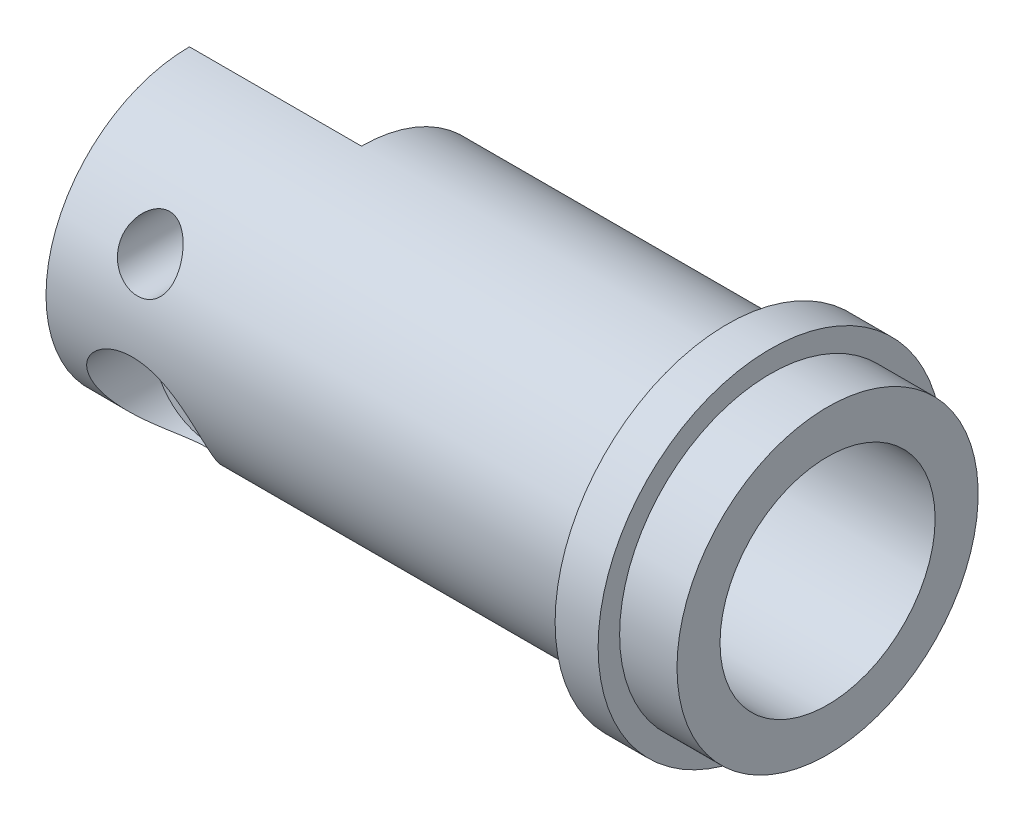
ISO-10303-21;
HEADER;
FILE_DESCRIPTION(('STEP AP214'),'2;1');
FILE_NAME('part.step','',(''),(''),'','','');
FILE_SCHEMA(('AUTOMOTIVE_DESIGN { 1 0 10303 214 1 1 1 1 }'));
ENDSEC;
DATA;
#1=APPLICATION_CONTEXT('core data for automotive mechanical design processes');
#2=APPLICATION_PROTOCOL_DEFINITION('international standard','automotive_design',2000,#1);
#3=PRODUCT_CONTEXT('',#1,'mechanical');
#4=PRODUCT('Part','Part','',(#3));
#5=PRODUCT_RELATED_PRODUCT_CATEGORY('part','',(#4));
#6=PRODUCT_DEFINITION_FORMATION('','',#4);
#7=PRODUCT_DEFINITION_CONTEXT('part definition',#1,'design');
#8=PRODUCT_DEFINITION('design','',#6,#7);
#9=PRODUCT_DEFINITION_SHAPE('','',#8);
#10=(LENGTH_UNIT() NAMED_UNIT(*) SI_UNIT(.MILLI.,.METRE.));
#11=(NAMED_UNIT(*) PLANE_ANGLE_UNIT() SI_UNIT($,.RADIAN.));
#12=(NAMED_UNIT(*) SI_UNIT($,.STERADIAN.) SOLID_ANGLE_UNIT());
#13=UNCERTAINTY_MEASURE_WITH_UNIT(LENGTH_MEASURE(1.E-05),#10,'distance_accuracy_value','');
#14=(GEOMETRIC_REPRESENTATION_CONTEXT(3) GLOBAL_UNCERTAINTY_ASSIGNED_CONTEXT((#13)) GLOBAL_UNIT_ASSIGNED_CONTEXT((#10,
#11,#12)) REPRESENTATION_CONTEXT('',''));
#15=CARTESIAN_POINT('',(0.,0.,0.));
#16=DIRECTION('',(0.,0.,1.));
#17=DIRECTION('',(1.,0.,0.));
#18=AXIS2_PLACEMENT_3D('',#15,#16,#17);
#19=CARTESIAN_POINT('',(28.2857142857142,0.,-10.));
#20=DIRECTION('',(1.,0.,0.));
#21=DIRECTION('',(0.,0.,-1.));
#22=AXIS2_PLACEMENT_3D('',#19,#20,#21);
#23=PLANE('',#22);
#24=CARTESIAN_POINT('',(28.2857142857142,0.,0.));
#25=DIRECTION('',(-1.,0.,0.));
#26=DIRECTION('',(0.,0.,1.));
#27=AXIS2_PLACEMENT_3D('',#24,#25,#26);
#28=CIRCLE('',#27,10.);
#29=CARTESIAN_POINT('',(28.2857142857142,10.,0.));
#30=VERTEX_POINT('',#29);
#31=CARTESIAN_POINT('',(28.2857142857142,2.5,-9.68245836551854));
#32=VERTEX_POINT('',#31);
#33=EDGE_CURVE('E105',#30,#32,#28,.T.);
#34=ORIENTED_EDGE('',*,*,#33,.T.);
#35=DIRECTION('',(0.,0.,1.));
#36=VECTOR('',#35,1.);
#37=CARTESIAN_POINT('',(28.2857142857142,2.5,-12.));
#38=LINE('',#37,#36);
#39=CARTESIAN_POINT('',(28.2857142857142,2.5,-1.6583123951777));
#40=VERTEX_POINT('',#39);
#41=EDGE_CURVE('E95',#32,#40,#38,.T.);
#42=ORIENTED_EDGE('',*,*,#41,.T.);
#43=CARTESIAN_POINT('',(28.2857142857142,0.,0.));
#44=DIRECTION('',(1.,0.,0.));
#45=DIRECTION('',(0.,0.,-1.));
#46=AXIS2_PLACEMENT_3D('',#43,#44,#45);
#47=CIRCLE('',#46,3.);
#48=CARTESIAN_POINT('',(28.2857142857142,3.,0.));
#49=VERTEX_POINT('',#48);
#50=EDGE_CURVE('E102',#40,#49,#47,.T.);
#51=ORIENTED_EDGE('',*,*,#50,.T.);
#52=DIRECTION('',(0.,-1.,0.));
#53=VECTOR('',#52,1.);
#54=CARTESIAN_POINT('',(28.2857142857142,-10.,0.));
#55=LINE('',#54,#53);
#56=EDGE_CURVE('E231',#30,#49,#55,.T.);
#57=ORIENTED_EDGE('',*,*,#56,.F.);
#58=EDGE_LOOP('',(#34,#42,#51,#57));
#59=FACE_BOUND('',#58,.T.);
#60=ADVANCED_FACE('F38',(#59),#23,.F.);
#61=CARTESIAN_POINT('',(28.2857142857142,0.,0.));
#62=DIRECTION('',(-1.,0.,0.));
#63=DIRECTION('',(0.,0.,1.));
#64=AXIS2_PLACEMENT_3D('',#61,#62,#63);
#65=CYLINDRICAL_SURFACE('',#64,10.);
#66=CARTESIAN_POINT('',(18.2857142857142,-4.75,8.79985795339902));
#67=CARTESIAN_POINT('',(18.2857146794941,-4.64775511107819,8.85504731481394));
#68=CARTESIAN_POINT('',(18.2896368453553,-4.54453071109827,8.90846095213378));
#69=CARTESIAN_POINT('',(18.3057495382989,-4.33680054123675,9.01141502919795));
#70=CARTESIAN_POINT('',(18.3179400695199,-4.23229477071377,9.06095546700354));
#71=CARTESIAN_POINT('',(18.3509754213236,-4.02260000063724,9.15597930084683));
#72=CARTESIAN_POINT('',(18.3718333296483,-3.91741020566567,9.20145643457565));
#73=CARTESIAN_POINT('',(18.4224622636949,-3.70743576191147,9.28804664079346));
#74=CARTESIAN_POINT('',(18.4522288475649,-3.60265093752256,9.32916187431385));
#75=CARTESIAN_POINT('',(18.5209723811106,-3.39396306671426,9.40709689541834));
#76=CARTESIAN_POINT('',(18.5599870624851,-3.29006548849983,9.44389813775748));
#77=CARTESIAN_POINT('',(18.6471546774966,-3.08466980799321,9.51296737058453));
#78=CARTESIAN_POINT('',(18.6953040663803,-2.9831707920558,9.54523711111156));
#79=CARTESIAN_POINT('',(18.800600196153,-2.78360596859954,9.60533170008504));
#80=CARTESIAN_POINT('',(18.8577451359448,-2.68553947861152,9.6331574360721));
#81=CARTESIAN_POINT('',(18.9807486412899,-2.49385997778815,9.68455001775173));
#82=CARTESIAN_POINT('',(19.0466067135786,-2.40024671525585,9.70811710435489));
#83=CARTESIAN_POINT('',(19.1820519717099,-2.22437376429263,9.74986125180663));
#84=CARTESIAN_POINT('',(19.2511181823591,-2.1417716317211,9.76828915628753));
#85=CARTESIAN_POINT('',(19.3960756948511,-1.9820361015592,9.80194870076438));
#86=CARTESIAN_POINT('',(19.4719692792461,-1.9049045484412,9.81717926609884));
#87=CARTESIAN_POINT('',(19.6300177027694,-1.75684154297299,9.84475389508233));
#88=CARTESIAN_POINT('',(19.7121705247828,-1.68590810889191,9.85709888347002));
#89=CARTESIAN_POINT('',(19.8822128467565,-1.55078437178929,9.87925898186115));
#90=CARTESIAN_POINT('',(19.9701044907674,-1.48659661262561,9.88907313947818));
#91=CARTESIAN_POINT('',(20.1505076009358,-1.36582991643035,9.90647340394846));
#92=CARTESIAN_POINT('',(20.242992282968,-1.30921266776541,9.9140709787808));
#93=CARTESIAN_POINT('',(20.4323608223241,-1.20361365636595,9.9274436776013));
#94=CARTESIAN_POINT('',(20.5292462611188,-1.15463466702627,9.93321814040717));
#95=CARTESIAN_POINT('',(20.82545215876,-1.01977373813559,9.94828276969731));
#96=CARTESIAN_POINT('',(21.030498947756,-0.945849627510296,9.95532973289955));
#97=CARTESIAN_POINT('',(21.4544476531009,-0.83102804828343,9.96558160558599));
#98=CARTESIAN_POINT('',(21.6735544473667,-0.79088778149875,9.96869917015171));
#99=CARTESIAN_POINT('',(22.11544782821,-0.747466089190872,9.97204974832455));
#100=CARTESIAN_POINT('',(22.3382346790694,-0.744187322488545,9.97228255385406));
#101=CARTESIAN_POINT('',(22.7833343788602,-0.774750726007538,9.96995471278495));
#102=CARTESIAN_POINT('',(23.0056232239184,-0.808941027110835,9.9673678696076));
#103=CARTESIAN_POINT('',(23.4412896392946,-0.914005631748541,9.95828029702202));
#104=CARTESIAN_POINT('',(23.6546668689979,-0.984881336067683,9.95177941815986));
#105=CARTESIAN_POINT('',(24.0660429674837,-1.16107027916307,9.93275959609781));
#106=CARTESIAN_POINT('',(24.2640645724472,-1.26633135241922,9.92024975556217));
#107=CARTESIAN_POINT('',(24.6392545058661,-1.50799212824612,9.88639380958243));
#108=CARTESIAN_POINT('',(24.8164258673304,-1.64438729334758,9.8650489913759));
#109=CARTESIAN_POINT('',(25.1422010704683,-1.94138366405249,9.81088183714781));
#110=CARTESIAN_POINT('',(25.2911960784052,-2.10158802281518,9.7782377795457));
#111=CARTESIAN_POINT('',(25.5597774841209,-2.44186936017587,9.69885119822265));
#112=CARTESIAN_POINT('',(25.679371112943,-2.62194143664539,9.65211214736628));
#113=CARTESIAN_POINT('',(25.8845430816403,-2.99152263484594,9.54395612369488));
#114=CARTESIAN_POINT('',(25.9707415839331,-3.18077794809889,9.48284445898325));
#115=CARTESIAN_POINT('',(26.1116997453273,-3.56519093735672,9.34511092187318));
#116=CARTESIAN_POINT('',(26.1664573174046,-3.76034900427681,9.26848802030756));
#117=CARTESIAN_POINT('',(26.2466981402137,-4.15618781597649,9.09801638719833));
#118=CARTESIAN_POINT('',(26.2712639064894,-4.35686048656,9.00372373967416));
#119=CARTESIAN_POINT('',(26.2906234846291,-4.75254006726405,8.80129863202815));
#120=CARTESIAN_POINT('',(26.2854007991653,-4.94754377772921,8.69315853537593));
#121=CARTESIAN_POINT('',(26.2460612829425,-5.35147198079036,8.4512579191186));
#122=CARTESIAN_POINT('',(26.2084547419214,-5.5591402769891,8.31598269435805));
#123=CARTESIAN_POINT('',(26.1042730453924,-5.95885041765435,8.03442679104681));
#124=CARTESIAN_POINT('',(26.0376995601643,-6.15089316235709,7.88814674745355));
#125=CARTESIAN_POINT('',(25.8634141838392,-6.55493904112593,7.55737289555156));
#126=CARTESIAN_POINT('',(25.7501040195886,-6.76311867145068,7.37113575339365));
#127=CARTESIAN_POINT('',(25.5563129437588,-7.05585022869819,7.08756920416176));
#128=CARTESIAN_POINT('',(25.4875701962631,-7.15035426705791,6.99213411421136));
#129=CARTESIAN_POINT('',(25.3424186207966,-7.33265924435742,6.80070169445068));
#130=CARTESIAN_POINT('',(25.2660115628085,-7.42046172273408,6.70470449925196));
#131=CARTESIAN_POINT('',(25.0889043253059,-7.60691311247108,6.49297395858474));
#132=CARTESIAN_POINT('',(24.9864645476016,-7.7039931970862,6.37730935125372));
#133=CARTESIAN_POINT('',(24.7702692949476,-7.88801872633861,6.14823112317327));
#134=CARTESIAN_POINT('',(24.656504352454,-7.97495555736646,6.03481948246804));
#135=CARTESIAN_POINT('',(24.417556159327,-8.13763138118246,5.81357883870568));
#136=CARTESIAN_POINT('',(24.2924356964671,-8.21342652659606,5.70572375516045));
#137=CARTESIAN_POINT('',(24.0290347893763,-8.35319824433156,5.49904951414225));
#138=CARTESIAN_POINT('',(23.8907805781017,-8.41719765504708,5.40021308663245));
#139=CARTESIAN_POINT('',(23.6372244252914,-8.51653321047923,5.24166256240013));
#140=CARTESIAN_POINT('',(23.5253561518934,-8.55499016572871,5.17847194440276));
#141=CARTESIAN_POINT('',(23.2929004655457,-8.6230150259751,5.06438594208686));
#142=CARTESIAN_POINT('',(23.1723188866411,-8.65258881157613,5.01348242818396));
#143=CARTESIAN_POINT('',(22.9210033452073,-8.70131720292245,4.92844638250117));
#144=CARTESIAN_POINT('',(22.7901487856486,-8.72031663966561,4.89456429081456));
#145=CARTESIAN_POINT('',(22.5902300988773,-8.73895653188558,4.86115066343775));
#146=CARTESIAN_POINT('',(22.5230139185758,-8.74352676891557,4.85291417875754));
#147=CARTESIAN_POINT('',(22.3879738103306,-8.74926370616404,4.84256319009267));
#148=CARTESIAN_POINT('',(22.3201499819509,-8.75043095409425,4.84044770093303));
#149=CARTESIAN_POINT('',(22.1345994737618,-8.74887073177324,4.84327466911685));
#150=CARTESIAN_POINT('',(22.0169302692819,-8.74263928146649,4.85456710353292));
#151=CARTESIAN_POINT('',(21.7855872336126,-8.72032348359024,4.8945318986435));
#152=CARTESIAN_POINT('',(21.6719192358562,-8.7042253330782,4.92322860631899));
#153=CARTESIAN_POINT('',(21.4094017881586,-8.65588586711764,5.00787155723049));
#154=CARTESIAN_POINT('',(21.2632823207255,-8.61985970716792,5.0699938000019));
#155=CARTESIAN_POINT('',(20.9836789446471,-8.53499839346329,5.21158406755795));
#156=CARTESIAN_POINT('',(20.8502347996003,-8.48612463226193,5.29110425081891));
#157=CARTESIAN_POINT('',(20.6116265802686,-8.38482645488855,5.44999280569964));
#158=CARTESIAN_POINT('',(20.5050330942832,-8.33366828778502,5.52806388275428));
#159=CARTESIAN_POINT('',(20.2998818315618,-8.22419080639052,5.68965880335219));
#160=CARTESIAN_POINT('',(20.2013301086767,-8.16586617844849,5.77318667114035));
#161=CARTESIAN_POINT('',(20.0115269712761,-8.04255051675777,5.94377659891021));
#162=CARTESIAN_POINT('',(19.9202844474032,-7.97755157739124,6.03084277449252));
#163=CARTESIAN_POINT('',(19.7447832363556,-7.84127923554748,6.20699166262044));
#164=CARTESIAN_POINT('',(19.660522814235,-7.77000740092127,6.29607386716685));
#165=CARTESIAN_POINT('',(19.4920525420548,-7.61523777637921,6.48259274575322));
#166=CARTESIAN_POINT('',(19.4084158814529,-7.53121659640131,6.58011437949339));
#167=CARTESIAN_POINT('',(19.2489693522834,-7.35618457687049,6.77523235200131));
#168=CARTESIAN_POINT('',(19.1731603915393,-7.2651729287224,6.87282869811457));
#169=CARTESIAN_POINT('',(18.957711698934,-6.98175315986275,7.16437838957821));
#170=CARTESIAN_POINT('',(18.8298958388948,-6.77881855009167,7.35726608972692));
#171=CARTESIAN_POINT('',(18.6663703326623,-6.45715121560881,7.63707517498089));
#172=CARTESIAN_POINT('',(18.6169707004613,-6.34838464316362,7.72777622572758));
#173=CARTESIAN_POINT('',(18.5274252728755,-6.12469234657474,7.90623638760143));
#174=CARTESIAN_POINT('',(18.4872810369777,-6.00976558848604,7.99399500081716));
#175=CARTESIAN_POINT('',(18.4172018933316,-5.77451649749031,8.16554384799699));
#176=CARTESIAN_POINT('',(18.38723821468,-5.65421047570024,8.24934467915798));
#177=CARTESIAN_POINT('',(18.3383051512679,-5.40850682607519,8.41247652812915));
#178=CARTESIAN_POINT('',(18.3193281313534,-5.28311279914317,8.49181061539713));
#179=CARTESIAN_POINT('',(18.2995511706024,-5.08907911150078,8.60856028115355));
#180=CARTESIAN_POINT('',(18.2943985183452,-5.02199402767022,8.64786879444251));
#181=CARTESIAN_POINT('',(18.2874790253192,-4.8867533021524,8.72500449564301));
#182=CARTESIAN_POINT('',(18.2857140215234,-4.81859709982711,8.76283086897166));
#183=CARTESIAN_POINT('',(18.2857142857142,-4.75,8.79985795339902));
#184=B_SPLINE_CURVE_WITH_KNOTS('',3,(#66,#67,#68,#69,#70,#71,#72,#73,#74,#75,#76,#77,#78,#79,
#80,#81,#82,#83,#84,#85,#86,#87,#88,#89,#90,#91,#92,#93,#94,#95,#96,#97,#98,#99,#100,#101,#102,
#103,#104,#105,#106,#107,#108,#109,#110,#111,#112,#113,#114,#115,#116,#117,#118,#119,#120,#121,
#122,#123,#124,#125,#126,#127,#128,#129,#130,#131,#132,#133,#134,#135,#136,#137,#138,#139,#140,
#141,#142,#143,#144,#145,#146,#147,#148,#149,#150,#151,#152,#153,#154,#155,#156,#157,#158,#159,
#160,#161,#162,#163,#164,#165,#166,#167,#168,#169,#170,#171,#172,#173,#174,#175,#176,#177,#178,
#179,#180,#181,#182,#183),.UNSPECIFIED.,.T.,.F.,(4,2,2,2,2,2,2,2,2,2,2,2,2,2,2,2,2,2,2,2,2,2,2,
2,2,2,2,2,2,2,2,2,2,2,2,2,2,2,2,2,2,2,2,2,2,2,2,2,2,2,2,2,2,2,2,2,2,2,4),(0.,0.348506595492741,
0.697013365431878,1.04604830405482,1.39490950349822,1.74521930733141,2.09539344932556,
2.44549756810713,2.79558187539324,3.12290123444997,3.45033043368665,3.77765455763118,
4.10510167898208,4.43082335140157,4.7566630169405,5.40771049860026,6.07298833538455,
6.73831415836707,7.40987443927385,8.08146036473431,8.75203213266483,9.42250623407782,
10.0828505865538,10.7430323695718,11.3902879635449,12.0375865168689,12.7041045835566,
13.3709918145921,14.1202623529282,14.8694896928651,15.7703127814435,16.2226863265906,
16.6749556408363,17.2217567837747,17.7690189394429,18.3134207275109,18.8567571340348,
19.2582143668942,19.6594052488116,20.0663376898303,20.2696300975172,20.4728897834456,
20.8259359256958,21.1794770899367,21.6651604721618,22.1523203721684,22.5767903452563,
23.0015769672888,23.426872677091,23.8520623884797,24.3121934644324,24.7723778446411,
25.6919364321268,26.1415794789613,26.5912982330759,27.0397352711888,27.4878602937334,
27.7215501063489,27.955366602934),.UNSPECIFIED.);
#185=CARTESIAN_POINT('',(18.2857142857142,-4.75,8.79985795339902));
#186=VERTEX_POINT('',#185);
#187=EDGE_CURVE('E129',#186,#186,#184,.T.);
#188=ORIENTED_EDGE('',*,*,#187,.T.);
#189=EDGE_LOOP('',(#188));
#190=FACE_BOUND('',#189,.T.);
#191=CARTESIAN_POINT('',(28.2857142857142,-2.5,-9.68245836551854));
#192=VERTEX_POINT('',#191);
#193=CARTESIAN_POINT('',(28.2857142857142,-10.,0.));
#194=VERTEX_POINT('',#193);
#195=EDGE_CURVE('E224',#192,#194,#28,.T.);
#196=ORIENTED_EDGE('',*,*,#195,.F.);
#197=CARTESIAN_POINT('',(30.7857142857142,0.,-10.));
#198=CARTESIAN_POINT('',(30.7857104094839,0.138126814449552,-9.99999766446687));
#199=CARTESIAN_POINT('',(30.7742283677579,0.276296929717938,-9.99710963553043));
#200=CARTESIAN_POINT('',(30.7286723668692,0.548677206284221,-9.98586856383157));
#201=CARTESIAN_POINT('',(30.6945856031511,0.682885078117899,-9.97751242366626));
#202=CARTESIAN_POINT('',(30.6049821966107,0.943368120304294,-9.9562604388672));
#203=CARTESIAN_POINT('',(30.5494912878554,1.06965260571667,-9.94337004736763));
#204=CARTESIAN_POINT('',(30.4187453023061,1.31112021984071,-9.91442239679369));
#205=CARTESIAN_POINT('',(30.3434895588492,1.4263029739146,-9.89836503090261));
#206=CARTESIAN_POINT('',(30.1737129696239,1.64466987883486,-9.86445689319489));
#207=CARTESIAN_POINT('',(30.0788616607824,1.74759281676843,-9.84657845246877));
#208=CARTESIAN_POINT('',(29.8732939441991,1.93624821200553,-9.8112270019656));
#209=CARTESIAN_POINT('',(29.7625757474693,2.02197872824865,-9.79375403816446));
#210=CARTESIAN_POINT('',(29.5263889078192,2.17504423799829,-9.76091292830281));
#211=CARTESIAN_POINT('',(29.4007255676996,2.2420870265419,-9.74557990774685));
#212=CARTESIAN_POINT('',(29.1394669329475,2.35399484758457,-9.71915824696694));
#213=CARTESIAN_POINT('',(29.0038732301608,2.39886342573357,-9.70806892824031));
#214=CARTESIAN_POINT('',(28.7294751220448,2.46425806134127,-9.69167461160538));
#215=CARTESIAN_POINT('',(28.5907894589842,2.48525378055342,-9.68625818328352));
#216=CARTESIAN_POINT('',(28.3117666707153,2.50376962511068,-9.68148937432652));
#217=CARTESIAN_POINT('',(28.171429817894,2.50129356969685,-9.68213600713214));
#218=CARTESIAN_POINT('',(27.8966879394719,2.47331087439951,-9.68932009194695));
#219=CARTESIAN_POINT('',(27.762221583272,2.44836390031772,-9.69571438345489));
#220=CARTESIAN_POINT('',(27.4994458675291,2.37704031150499,-9.71344516118448));
#221=CARTESIAN_POINT('',(27.3711369473327,2.33066217011565,-9.72478199948731));
#222=CARTESIAN_POINT('',(27.1228175919606,2.21731579656197,-9.75125189842765));
#223=CARTESIAN_POINT('',(27.0029039993982,2.1501444453882,-9.76642212449693));
#224=CARTESIAN_POINT('',(26.7758497694528,1.99726046002491,-9.79882851409985));
#225=CARTESIAN_POINT('',(26.6687113722688,1.91154458134806,-9.81606503891047));
#226=CARTESIAN_POINT('',(26.4670415928902,1.72110570780203,-9.85126467566485));
#227=CARTESIAN_POINT('',(26.3729568022786,1.61591043027643,-9.86923449130001));
#228=CARTESIAN_POINT('',(26.2036788816077,1.39101986250616,-9.90343275964593));
#229=CARTESIAN_POINT('',(26.1284863286083,1.27132412951324,-9.91966115915679));
#230=CARTESIAN_POINT('',(25.9989633086736,1.02019314780232,-9.9486288682365));
#231=CARTESIAN_POINT('',(25.9447053852901,0.888718988681039,-9.96135600212878));
#232=CARTESIAN_POINT('',(25.8591854428649,0.618126680238137,-9.98179861652361));
#233=CARTESIAN_POINT('',(25.8279190250173,0.47900999858414,-9.98951505565468));
#234=CARTESIAN_POINT('',(25.7899516764495,0.200899950650044,-9.99892498785624));
#235=CARTESIAN_POINT('',(25.7826425755887,0.0619945333136832,-10.0007675584713));
#236=CARTESIAN_POINT('',(25.79112928914,-0.215054791335847,-9.99864674690754));
#237=CARTESIAN_POINT('',(25.8069230237128,-0.353198766074327,-9.99468388736421));
#238=CARTESIAN_POINT('',(25.8606657996998,-0.622690447960817,-9.98149301878918));
#239=CARTESIAN_POINT('',(25.8982830581758,-0.754108531614583,-9.97234390309647));
#240=CARTESIAN_POINT('',(25.9942260924283,-1.00876215408753,-9.94981177723595));
#241=CARTESIAN_POINT('',(26.0525539595696,-1.13199686505442,-9.93642833949965));
#242=CARTESIAN_POINT('',(26.189441167172,-1.36920522404972,-9.9065551321037));
#243=CARTESIAN_POINT('',(26.2683411397085,-1.48297573639294,-9.89001445610999));
#244=CARTESIAN_POINT('',(26.4436974670428,-1.69587768940552,-9.85574181979586));
#245=CARTESIAN_POINT('',(26.5401568517436,-1.79500659828875,-9.83800965421577));
#246=CARTESIAN_POINT('',(26.750717553787,-1.97831761345414,-9.80281594932497));
#247=CARTESIAN_POINT('',(26.8651937907135,-2.06207311270184,-9.78537173637463));
#248=CARTESIAN_POINT('',(27.1069353431618,-2.20918459835604,-9.75321463970069));
#249=CARTESIAN_POINT('',(27.2342000906649,-2.27254149026901,-9.73850163474941));
#250=CARTESIAN_POINT('',(27.4972238230579,-2.37658570101223,-9.71363491194665));
#251=CARTESIAN_POINT('',(27.632926999568,-2.41740732773931,-9.70345425375809));
#252=CARTESIAN_POINT('',(27.9095636821397,-2.47557609990489,-9.68877906706585));
#253=CARTESIAN_POINT('',(28.0504960374166,-2.49292837912652,-9.68428329504044));
#254=CARTESIAN_POINT('',(28.3292493254835,-2.50339765056083,-9.68158168701612));
#255=CARTESIAN_POINT('',(28.4670433442583,-2.49719649630131,-9.68319887888034));
#256=CARTESIAN_POINT('',(28.739554100158,-2.46229546385366,-9.69213181672143));
#257=CARTESIAN_POINT('',(28.8742708990695,-2.43359603781098,-9.69944744817731));
#258=CARTESIAN_POINT('',(29.1360617174906,-2.35488553240495,-9.71885434473222));
#259=CARTESIAN_POINT('',(29.2631764611147,-2.30500234113404,-9.73091692061057));
#260=CARTESIAN_POINT('',(29.5073232569035,-2.18544152267503,-9.7584625954084));
#261=CARTESIAN_POINT('',(29.6243539076923,-2.11576115005696,-9.77394616867808));
#262=CARTESIAN_POINT('',(29.848305334051,-1.95644624772858,-9.80709390439337));
#263=CARTESIAN_POINT('',(29.9548827414208,-1.86633860485376,-9.82480441386302));
#264=CARTESIAN_POINT('',(30.1516260270399,-1.66964895198288,-9.86013378743769));
#265=CARTESIAN_POINT('',(30.2417880025691,-1.56306303543524,-9.87775262878422));
#266=CARTESIAN_POINT('',(30.4047331333219,-1.33411264450432,-9.91129426079449));
#267=CARTESIAN_POINT('',(30.4771719751668,-1.21149737052731,-9.92718055609783));
#268=CARTESIAN_POINT('',(30.6002933906151,-0.955443432517459,-9.95508208291861));
#269=CARTESIAN_POINT('',(30.6509915534618,-0.822012605727898,-9.96710008666301));
#270=CARTESIAN_POINT('',(30.7216673362636,-0.574017088739119,-9.98413432609236));
#271=CARTESIAN_POINT('',(30.7456330241366,-0.460633618180113,-9.99004308421151));
#272=CARTESIAN_POINT('',(30.7776575250841,-0.231510119227138,-9.9979767538658));
#273=CARTESIAN_POINT('',(30.7857175345564,-0.115770268737693,-10.0000019575149));
#274=CARTESIAN_POINT('',(30.7857142857142,0.,-10.));
#275=B_SPLINE_CURVE_WITH_KNOTS('',3,(#197,#198,#199,#200,#201,#202,#203,#204,#205,#206,#207,
#208,#209,#210,#211,#212,#213,#214,#215,#216,#217,#218,#219,#220,#221,#222,#223,#224,#225,#226,
#227,#228,#229,#230,#231,#232,#233,#234,#235,#236,#237,#238,#239,#240,#241,#242,#243,#244,#245,
#246,#247,#248,#249,#250,#251,#252,#253,#254,#255,#256,#257,#258,#259,#260,#261,#262,#263,#264,
#265,#266,#267,#268,#269,#270,#271,#272,#273,#274),.UNSPECIFIED.,.T.,.F.,(4,2,2,2,2,2,2,2,2,2,2,
2,2,2,2,2,2,2,2,2,2,2,2,2,2,2,2,2,2,2,2,2,2,2,2,2,2,2,4),(0.,0.413956187453149,
0.828147062939832,1.24184150381017,1.65554990028221,2.07690725728565,2.49831215966769,
2.92597745909678,3.3535743528228,3.77260491835116,4.19156730193363,4.60037495017231,
5.00921172448931,5.42217546462,5.83521151399138,6.26002501620566,6.68485149269279,
7.11113715020724,7.53734122819939,7.95263848254328,8.36789835193439,8.7770045752893,
9.18615212209352,9.60255979281121,10.0190393835223,10.4457418201299,10.8724253125471,
11.2965375769764,11.7205570543048,12.1323963400748,12.5442273493652,12.9536066760888,
13.3630428023796,13.7831596069298,14.2033761629383,14.6312030917578,15.0587227304538,
15.4057040491338,15.752659267482),.UNSPECIFIED.);
#276=EDGE_CURVE('E106',#192,#32,#275,.T.);
#277=ORIENTED_EDGE('',*,*,#276,.T.);
#278=ORIENTED_EDGE('',*,*,#33,.F.);
#279=DIRECTION('',(1.,0.,0.));
#280=VECTOR('',#279,1.);
#281=CARTESIAN_POINT('',(16.2857142857142,10.,0.));
#282=LINE('',#281,#280);
#283=CARTESIAN_POINT('',(16.2857142857142,10.,0.));
#284=VERTEX_POINT('',#283);
#285=EDGE_CURVE('E225',#284,#30,#282,.T.);
#286=ORIENTED_EDGE('',*,*,#285,.F.);
#287=CARTESIAN_POINT('',(16.2857142857142,0.,0.));
#288=DIRECTION('',(-1.,0.,0.));
#289=DIRECTION('',(0.,0.,1.));
#290=AXIS2_PLACEMENT_3D('',#287,#288,#289);
#291=CIRCLE('',#290,10.);
#292=CARTESIAN_POINT('',(16.2857142857142,-10.,0.));
#293=VERTEX_POINT('',#292);
#294=EDGE_CURVE('E138',#293,#284,#291,.T.);
#295=ORIENTED_EDGE('',*,*,#294,.F.);
#296=DIRECTION('',(1.,0.,0.));
#297=VECTOR('',#296,1.);
#298=CARTESIAN_POINT('',(16.2857142857142,-10.,0.));
#299=LINE('',#298,#297);
#300=EDGE_CURVE('E228',#293,#194,#299,.T.);
#301=ORIENTED_EDGE('',*,*,#300,.T.);
#302=EDGE_LOOP('',(#196,#277,#278,#286,#295,#301));
#303=FACE_BOUND('',#302,.T.);
#304=CARTESIAN_POINT('',(53.7857142857142,0.,0.));
#305=DIRECTION('',(-1.,0.,0.));
#306=DIRECTION('',(0.,0.,1.));
#307=AXIS2_PLACEMENT_3D('',#304,#305,#306);
#308=CIRCLE('',#307,10.);
#309=CARTESIAN_POINT('',(53.7857142857142,0.,10.));
#310=VERTEX_POINT('',#309);
#311=EDGE_CURVE('E220',#310,#310,#308,.T.);
#312=ORIENTED_EDGE('',*,*,#311,.T.);
#313=EDGE_LOOP('',(#312));
#314=FACE_BOUND('',#313,.T.);
#315=CARTESIAN_POINT('',(20.2857142857142,4.75,8.79985795339902));
#316=CARTESIAN_POINT('',(20.2857174122233,4.63611302348021,8.86132889648042));
#317=CARTESIAN_POINT('',(20.2954638853175,4.52087060838558,8.92065520830488));
#318=CARTESIAN_POINT('',(20.3356148491503,4.29091196710132,9.03352224279783));
#319=CARTESIAN_POINT('',(20.3660534028912,4.17619692303822,9.08705325662404));
#320=CARTESIAN_POINT('',(20.4483847307604,3.95084169300878,9.18727965836942));
#321=CARTESIAN_POINT('',(20.5003647226387,3.84022008725185,9.23394620025199));
#322=CARTESIAN_POINT('',(20.6253811049275,3.62821143735412,9.31928884297307));
#323=CARTESIAN_POINT('',(20.6983997180841,3.5268166914685,9.35797164276212));
#324=CARTESIAN_POINT('',(20.8565807691002,3.34617766149028,9.42398827831217));
#325=CARTESIAN_POINT('',(20.9401295450089,3.26577293663598,9.45201751312901));
#326=CARTESIAN_POINT('',(21.1211430478798,3.11988652773928,9.50117095860801));
#327=CARTESIAN_POINT('',(21.2186037049046,3.05440049371085,9.52229718282955));
#328=CARTESIAN_POINT('',(21.4179339622194,2.94470673878336,9.55676789310697));
#329=CARTESIAN_POINT('',(21.5191418918612,2.89942067725638,9.57051788313139));
#330=CARTESIAN_POINT('',(21.7281892938472,2.8260904678972,9.59242871031496));
#331=CARTESIAN_POINT('',(21.83602762586,2.79804336429207,9.60059050564723));
#332=CARTESIAN_POINT('',(22.0525781647295,2.76066757383711,9.61140399754286));
#333=CARTESIAN_POINT('',(22.161212206795,2.75092016647324,9.61417900261354));
#334=CARTESIAN_POINT('',(22.3786302962995,2.74920454540623,9.61466984938524));
#335=CARTESIAN_POINT('',(22.4874143358011,2.75723542450062,9.6123859492355));
#336=CARTESIAN_POINT('',(22.701451559754,2.79070543347218,9.60272144847094));
#337=CARTESIAN_POINT('',(22.8067201828817,2.81605367925973,9.59536745461797));
#338=CARTESIAN_POINT('',(23.0113516213352,2.88317262974251,9.57541290247329));
#339=CARTESIAN_POINT('',(23.1107146012368,2.92494287654966,9.56281249046478));
#340=CARTESIAN_POINT('',(23.3011626938672,3.02361394447491,9.53207351820711));
#341=CARTESIAN_POINT('',(23.3922152599947,3.08057109403891,9.51391430236682));
#342=CARTESIAN_POINT('',(23.5632307774569,3.20750413694099,9.4718727477138));
#343=CARTESIAN_POINT('',(23.6431935317773,3.27748026151403,9.44799030724652));
#344=CARTESIAN_POINT('',(23.7914980617662,3.42936229643585,9.39393805484844));
#345=CARTESIAN_POINT('',(23.8596026057768,3.5114616608801,9.36366200597258));
#346=CARTESIAN_POINT('',(23.9810729779655,3.68375549124875,9.2972289197816));
#347=CARTESIAN_POINT('',(24.034436497495,3.77395122224892,9.26107096268548));
#348=CARTESIAN_POINT('',(24.1279932014204,3.96402280682886,9.18137409687226));
#349=CARTESIAN_POINT('',(24.1674313982989,4.06415548761164,9.13756423993298));
#350=CARTESIAN_POINT('',(24.2294406277473,4.2670920206269,9.04457850970563));
#351=CARTESIAN_POINT('',(24.252005539093,4.36989682826163,8.99540069645846));
#352=CARTESIAN_POINT('',(24.2820850918395,4.58476283188008,8.88794837160016));
#353=CARTESIAN_POINT('',(24.2880673560789,4.6968267600241,8.82925356373616));
#354=CARTESIAN_POINT('',(24.2817067262176,4.91820884222196,8.70788104801617));
#355=CARTESIAN_POINT('',(24.2693572704366,5.02752599884798,8.64520192169558));
#356=CARTESIAN_POINT('',(24.2250289077787,5.25386261673348,8.50977572353418));
#357=CARTESIAN_POINT('',(24.190911152813,5.37027473041372,8.43671183838761));
#358=CARTESIAN_POINT('',(24.1025889529419,5.59471111954333,8.2895873758223));
#359=CARTESIAN_POINT('',(24.0483594484628,5.70272472633964,8.21552566651659));
#360=CARTESIAN_POINT('',(23.9152546805972,5.9169895654821,8.06275294420545));
#361=CARTESIAN_POINT('',(23.834657303918,6.02228549542965,7.98419178984015));
#362=CARTESIAN_POINT('',(23.6514801619557,6.21714367665246,7.83340517402907));
#363=CARTESIAN_POINT('',(23.5489363728792,6.30673124616735,7.76116961305333));
#364=CARTESIAN_POINT('',(23.3588088328619,6.44035806765816,7.65027946781038));
#365=CARTESIAN_POINT('',(23.2769548734186,6.48979516390082,7.60828002170343));
#366=CARTESIAN_POINT('',(23.1039703453849,6.57751782943039,7.53256972843362));
#367=CARTESIAN_POINT('',(23.0128556148897,6.61582201947526,7.49884505588531));
#368=CARTESIAN_POINT('',(22.8378952556453,6.67411012209558,7.44698190067855));
#369=CARTESIAN_POINT('',(22.7551835271939,6.69603466565535,7.42722091667859));
#370=CARTESIAN_POINT('',(22.5859655910647,6.72920804047315,7.39717985828746));
#371=CARTESIAN_POINT('',(22.4994618988753,6.74046384023715,7.38689359541446));
#372=CARTESIAN_POINT('',(22.324829259051,6.75153572962507,7.37677626157377));
#373=CARTESIAN_POINT('',(22.2366961252152,6.75131646739075,7.37697750002349));
#374=CARTESIAN_POINT('',(22.0618813787109,6.73936671933244,7.38789524420425));
#375=CARTESIAN_POINT('',(21.9752000585527,6.72763394148674,7.39861384365018));
#376=CARTESIAN_POINT('',(21.8094655178192,6.69423003709854,7.42884614259243));
#377=CARTESIAN_POINT('',(21.7302445113887,6.67301190647457,7.44795832535163));
#378=CARTESIAN_POINT('',(21.5768566807794,6.62191579928934,7.49342371570476));
#379=CARTESIAN_POINT('',(21.5026930376855,6.59203243322995,7.51978142925403));
#380=CARTESIAN_POINT('',(21.3300192400063,6.51046424784763,7.59064289061905));
#381=CARTESIAN_POINT('',(21.2345443224787,6.45491025902586,7.63809930286131));
#382=CARTESIAN_POINT('',(21.0566163968725,6.33148269345216,7.74072234553407));
#383=CARTESIAN_POINT('',(20.974183785842,6.26359016966574,7.79590080353772));
#384=CARTESIAN_POINT('',(20.8213675506575,6.11642869039862,7.91190411986382));
#385=CARTESIAN_POINT('',(20.7512170617061,6.0369832322233,7.97281015068256));
#386=CARTESIAN_POINT('',(20.6249430481062,5.86931256539442,8.09704113806142));
#387=CARTESIAN_POINT('',(20.5688267697594,5.7810828538902,8.16036732485111));
#388=CARTESIAN_POINT('',(20.4604392043207,5.57730257592618,8.30133547595681));
#389=CARTESIAN_POINT('',(20.4116431909775,5.45997743048045,8.37910272028206));
#390=CARTESIAN_POINT('',(20.3369032343833,5.21712593216542,8.53241596091703));
#391=CARTESIAN_POINT('',(20.3109090412068,5.09161827128159,8.60796648513223));
#392=CARTESIAN_POINT('',(20.2933688330081,4.9283804784174,8.70130650214022));
#393=CARTESIAN_POINT('',(20.2905091990904,4.89292656162934,8.7212917524535));
#394=CARTESIAN_POINT('',(20.2866812383386,4.82169340381837,8.76087513059886));
#395=CARTESIAN_POINT('',(20.285713299774,4.78591409752314,8.78047317814088));
#396=CARTESIAN_POINT('',(20.2857142857142,4.75,8.79985795339902));
#397=B_SPLINE_CURVE_WITH_KNOTS('',3,(#315,#316,#317,#318,#319,#320,#321,#322,#323,#324,#325,
#326,#327,#328,#329,#330,#331,#332,#333,#334,#335,#336,#337,#338,#339,#340,#341,#342,#343,#344,
#345,#346,#347,#348,#349,#350,#351,#352,#353,#354,#355,#356,#357,#358,#359,#360,#361,#362,#363,
#364,#365,#366,#367,#368,#369,#370,#371,#372,#373,#374,#375,#376,#377,#378,#379,#380,#381,#382,
#383,#384,#385,#386,#387,#388,#389,#390,#391,#392,#393,#394,#395,#396),.UNSPECIFIED.,.T.,.F.,(4,
2,2,2,2,2,2,2,2,2,2,2,2,2,2,2,2,2,2,2,2,2,2,2,2,2,2,2,2,2,2,2,2,2,2,2,2,2,2,2,4),(0.,
0.388108727831739,0.776857906718235,1.16719668783551,1.557206602207,1.91321551305612,
2.26912048572655,2.60266565449601,2.93615361800925,3.26191328971577,3.58765633871982,
3.91170284164913,4.23574030996017,4.56099677190172,4.88625901139886,5.21742407444845,
5.54864097316898,5.89575378221317,6.24299245446904,6.6213931372125,6.9999292978642,
7.42300880382161,7.846617254774,8.30675731562927,8.76614878013743,9.07838529553598,
9.39009652243447,9.65244414733885,9.91462029625627,10.1776041931433,10.4406404534547,
10.6922712107368,10.9440588112026,11.3027695131242,11.6620357778707,12.0275177461703,
12.3931880364336,12.8381886939629,13.2822061914768,13.404570619173,13.52696015946),.UNSPECIFIED.);
#398=CARTESIAN_POINT('',(20.2857142857142,4.75,8.79985795339902));
#399=VERTEX_POINT('',#398);
#400=EDGE_CURVE('E125',#399,#399,#397,.T.);
#401=ORIENTED_EDGE('',*,*,#400,.F.);
#402=EDGE_LOOP('',(#401));
#403=FACE_BOUND('',#402,.T.);
#404=ADVANCED_FACE('F140',(#190,#303,#314,#403),#65,.T.);
#405=CARTESIAN_POINT('',(28.2857142857142,-3.,0.));
#406=VERTEX_POINT('',#405);
#407=CARTESIAN_POINT('',(28.2857142857142,-2.5,-1.6583123951777));
#408=VERTEX_POINT('',#407);
#409=EDGE_CURVE('E112',#406,#408,#47,.T.);
#410=ORIENTED_EDGE('',*,*,#409,.T.);
#411=DIRECTION('',(0.,0.,1.));
#412=VECTOR('',#411,1.);
#413=CARTESIAN_POINT('',(28.2857142857142,-2.5,-12.));
#414=LINE('',#413,#412);
#415=EDGE_CURVE('E59',#408,#192,#414,.F.);
#416=ORIENTED_EDGE('',*,*,#415,.T.);
#417=ORIENTED_EDGE('',*,*,#195,.T.);
#418=EDGE_CURVE('E137',#406,#194,#55,.T.);
#419=ORIENTED_EDGE('',*,*,#418,.F.);
#420=EDGE_LOOP('',(#410,#416,#417,#419));
#421=FACE_BOUND('',#420,.T.);
#422=ADVANCED_FACE('F40',(#421),#23,.F.);
#423=CARTESIAN_POINT('',(40.7857142857142,0.,-7.5));
#424=DIRECTION('',(-1.,0.,0.));
#425=DIRECTION('',(0.,0.,1.));
#426=AXIS2_PLACEMENT_3D('',#423,#424,#425);
#427=PLANE('',#426);
#428=CARTESIAN_POINT('',(40.7857142857142,0.,0.));
#429=DIRECTION('',(1.,0.,0.));
#430=DIRECTION('',(0.,0.,-1.));
#431=AXIS2_PLACEMENT_3D('',#428,#429,#430);
#432=CIRCLE('',#431,3.);
#433=CARTESIAN_POINT('',(40.7857142857142,0.,-3.));
#434=VERTEX_POINT('',#433);
#435=EDGE_CURVE('E115',#434,#434,#432,.T.);
#436=ORIENTED_EDGE('',*,*,#435,.F.);
#437=EDGE_LOOP('',(#436));
#438=FACE_BOUND('',#437,.T.);
#439=CARTESIAN_POINT('',(40.7857142857142,0.,0.));
#440=DIRECTION('',(-1.,0.,0.));
#441=DIRECTION('',(0.,0.,1.));
#442=AXIS2_PLACEMENT_3D('',#439,#440,#441);
#443=CIRCLE('',#442,7.5);
#444=CARTESIAN_POINT('',(40.7857142857142,0.,7.5));
#445=VERTEX_POINT('',#444);
#446=EDGE_CURVE('E195',#445,#445,#443,.T.);
#447=ORIENTED_EDGE('',*,*,#446,.F.);
#448=EDGE_LOOP('',(#447));
#449=FACE_BOUND('',#448,.T.);
#450=ADVANCED_FACE('F176',(#438,#449),#427,.F.);
#451=CARTESIAN_POINT('',(28.2857142857142,0.,0.));
#452=DIRECTION('',(-1.,0.,0.));
#453=DIRECTION('',(0.,0.,1.));
#454=AXIS2_PLACEMENT_3D('',#451,#452,#453);
#455=CYLINDRICAL_SURFACE('',#454,7.5);
#456=CARTESIAN_POINT('',(60.7857142857142,0.,0.));
#457=DIRECTION('',(-1.,0.,0.));
#458=DIRECTION('',(0.,0.,1.));
#459=AXIS2_PLACEMENT_3D('',#456,#457,#458);
#460=CIRCLE('',#459,7.5);
#461=CARTESIAN_POINT('',(60.7857142857142,0.,7.5));
#462=VERTEX_POINT('',#461);
#463=EDGE_CURVE('E205',#462,#462,#460,.T.);
#464=ORIENTED_EDGE('',*,*,#463,.F.);
#465=EDGE_LOOP('',(#464));
#466=FACE_BOUND('',#465,.T.);
#467=ORIENTED_EDGE('',*,*,#446,.T.);
#468=EDGE_LOOP('',(#467));
#469=FACE_BOUND('',#468,.T.);
#470=ADVANCED_FACE('F181',(#466,#469),#455,.F.);
#471=CARTESIAN_POINT('',(60.7857142857142,0.,-7.5));
#472=DIRECTION('',(-1.,0.,0.));
#473=DIRECTION('',(0.,0.,1.));
#474=AXIS2_PLACEMENT_3D('',#471,#472,#473);
#475=PLANE('',#474);
#476=CARTESIAN_POINT('',(60.7857142857142,0.,0.));
#477=DIRECTION('',(-1.,0.,0.));
#478=DIRECTION('',(0.,0.,1.));
#479=AXIS2_PLACEMENT_3D('',#476,#477,#478);
#480=CIRCLE('',#479,10.5);
#481=CARTESIAN_POINT('',(60.7857142857142,0.,10.5));
#482=VERTEX_POINT('',#481);
#483=EDGE_CURVE('E208',#482,#482,#480,.T.);
#484=ORIENTED_EDGE('',*,*,#483,.F.);
#485=EDGE_LOOP('',(#484));
#486=FACE_BOUND('',#485,.T.);
#487=ORIENTED_EDGE('',*,*,#463,.T.);
#488=EDGE_LOOP('',(#487));
#489=FACE_BOUND('',#488,.T.);
#490=ADVANCED_FACE('F318',(#486,#489),#475,.F.);
#491=CARTESIAN_POINT('',(28.2857142857142,0.,0.));
#492=DIRECTION('',(-1.,0.,0.));
#493=DIRECTION('',(0.,0.,1.));
#494=AXIS2_PLACEMENT_3D('',#491,#492,#493);
#495=CYLINDRICAL_SURFACE('',#494,10.5);
#496=CARTESIAN_POINT('',(56.7857142857142,0.,0.));
#497=DIRECTION('',(-1.,0.,0.));
#498=DIRECTION('',(0.,0.,1.));
#499=AXIS2_PLACEMENT_3D('',#496,#497,#498);
#500=CIRCLE('',#499,10.5);
#501=CARTESIAN_POINT('',(56.7857142857142,0.,10.5));
#502=VERTEX_POINT('',#501);
#503=EDGE_CURVE('E211',#502,#502,#500,.T.);
#504=ORIENTED_EDGE('',*,*,#503,.F.);
#505=EDGE_LOOP('',(#504));
#506=FACE_BOUND('',#505,.T.);
#507=ORIENTED_EDGE('',*,*,#483,.T.);
#508=EDGE_LOOP('',(#507));
#509=FACE_BOUND('',#508,.T.);
#510=ADVANCED_FACE('F308',(#506,#509),#495,.T.);
#511=CARTESIAN_POINT('',(56.7857142857142,0.,-10.5));
#512=DIRECTION('',(-1.,0.,0.));
#513=DIRECTION('',(0.,0.,1.));
#514=AXIS2_PLACEMENT_3D('',#511,#512,#513);
#515=PLANE('',#514);
#516=CARTESIAN_POINT('',(56.7857142857142,0.,0.));
#517=DIRECTION('',(-1.,0.,0.));
#518=DIRECTION('',(0.,0.,1.));
#519=AXIS2_PLACEMENT_3D('',#516,#517,#518);
#520=CIRCLE('',#519,12.);
#521=CARTESIAN_POINT('',(56.7857142857142,0.,12.));
#522=VERTEX_POINT('',#521);
#523=EDGE_CURVE('E214',#522,#522,#520,.T.);
#524=ORIENTED_EDGE('',*,*,#523,.F.);
#525=EDGE_LOOP('',(#524));
#526=FACE_BOUND('',#525,.T.);
#527=ORIENTED_EDGE('',*,*,#503,.T.);
#528=EDGE_LOOP('',(#527));
#529=FACE_BOUND('',#528,.T.);
#530=ADVANCED_FACE('F298',(#526,#529),#515,.F.);
#531=CARTESIAN_POINT('',(28.2857142857142,0.,0.));
#532=DIRECTION('',(-1.,0.,0.));
#533=DIRECTION('',(0.,0.,1.));
#534=AXIS2_PLACEMENT_3D('',#531,#532,#533);
#535=CYLINDRICAL_SURFACE('',#534,12.);
#536=CARTESIAN_POINT('',(53.7857142857142,0.,0.));
#537=DIRECTION('',(-1.,0.,0.));
#538=DIRECTION('',(0.,0.,1.));
#539=AXIS2_PLACEMENT_3D('',#536,#537,#538);
#540=CIRCLE('',#539,12.);
#541=CARTESIAN_POINT('',(53.7857142857142,0.,12.));
#542=VERTEX_POINT('',#541);
#543=EDGE_CURVE('E217',#542,#542,#540,.T.);
#544=ORIENTED_EDGE('',*,*,#543,.F.);
#545=EDGE_LOOP('',(#544));
#546=FACE_BOUND('',#545,.T.);
#547=ORIENTED_EDGE('',*,*,#523,.T.);
#548=EDGE_LOOP('',(#547));
#549=FACE_BOUND('',#548,.T.);
#550=ADVANCED_FACE('F167',(#546,#549),#535,.T.);
#551=CARTESIAN_POINT('',(53.7857142857142,0.,-12.));
#552=DIRECTION('',(1.,0.,0.));
#553=DIRECTION('',(0.,0.,-1.));
#554=AXIS2_PLACEMENT_3D('',#551,#552,#553);
#555=PLANE('',#554);
#556=ORIENTED_EDGE('',*,*,#311,.F.);
#557=EDGE_LOOP('',(#556));
#558=FACE_BOUND('',#557,.T.);
#559=ORIENTED_EDGE('',*,*,#543,.T.);
#560=EDGE_LOOP('',(#559));
#561=FACE_BOUND('',#560,.T.);
#562=ADVANCED_FACE('F162',(#558,#561),#555,.F.);
#563=CARTESIAN_POINT('',(16.2857142857142,-10.,0.));
#564=DIRECTION('',(0.,0.,1.));
#565=DIRECTION('',(1.,0.,0.));
#566=AXIS2_PLACEMENT_3D('',#563,#564,#565);
#567=PLANE('',#566);
#568=CARTESIAN_POINT('',(22.2857142857142,4.75,0.));
#569=DIRECTION('',(0.,0.,1.));
#570=DIRECTION('',(1.,0.,0.));
#571=AXIS2_PLACEMENT_3D('',#568,#569,#570);
#572=CIRCLE('',#571,2.);
#573=CARTESIAN_POINT('',(24.2857142857142,4.75,0.));
#574=VERTEX_POINT('',#573);
#575=EDGE_CURVE('E122',#574,#574,#572,.T.);
#576=ORIENTED_EDGE('',*,*,#575,.T.);
#577=EDGE_LOOP('',(#576));
#578=FACE_BOUND('',#577,.T.);
#579=CARTESIAN_POINT('',(22.2857142857142,-4.75,0.));
#580=DIRECTION('',(0.,0.,1.));
#581=DIRECTION('',(1.,0.,0.));
#582=AXIS2_PLACEMENT_3D('',#579,#580,#581);
#583=CIRCLE('',#582,2.);
#584=CARTESIAN_POINT('',(24.2857142857142,-4.75,0.));
#585=VERTEX_POINT('',#584);
#586=EDGE_CURVE('E126',#585,#585,#583,.T.);
#587=ORIENTED_EDGE('',*,*,#586,.T.);
#588=EDGE_LOOP('',(#587));
#589=FACE_BOUND('',#588,.T.);
#590=DIRECTION('',(1.,0.,0.));
#591=VECTOR('',#590,1.);
#592=CARTESIAN_POINT('',(26.2857142857142,3.,0.));
#593=LINE('',#592,#591);
#594=CARTESIAN_POINT('',(26.2857142857142,3.,0.));
#595=VERTEX_POINT('',#594);
#596=EDGE_CURVE('E110',#49,#595,#593,.F.);
#597=ORIENTED_EDGE('',*,*,#596,.T.);
#598=DIRECTION('',(0.,1.,0.));
#599=VECTOR('',#598,1.);
#600=CARTESIAN_POINT('',(26.2857142857142,-10.,0.));
#601=LINE('',#600,#599);
#602=CARTESIAN_POINT('',(26.2857142857142,-3.,0.));
#603=VERTEX_POINT('',#602);
#604=EDGE_CURVE('E191',#603,#595,#601,.T.);
#605=ORIENTED_EDGE('',*,*,#604,.F.);
#606=DIRECTION('',(1.,0.,0.));
#607=VECTOR('',#606,1.);
#608=CARTESIAN_POINT('',(26.2857142857142,-3.,0.));
#609=LINE('',#608,#607);
#610=EDGE_CURVE('E52',#603,#406,#609,.T.);
#611=ORIENTED_EDGE('',*,*,#610,.T.);
#612=ORIENTED_EDGE('',*,*,#418,.T.);
#613=ORIENTED_EDGE('',*,*,#300,.F.);
#614=DIRECTION('',(0.,-1.,0.));
#615=VECTOR('',#614,1.);
#616=CARTESIAN_POINT('',(16.2857142857142,-10.,0.));
#617=LINE('',#616,#615);
#618=EDGE_CURVE('E230',#284,#293,#617,.T.);
#619=ORIENTED_EDGE('',*,*,#618,.F.);
#620=ORIENTED_EDGE('',*,*,#285,.T.);
#621=ORIENTED_EDGE('',*,*,#56,.T.);
#622=EDGE_LOOP('',(#597,#605,#611,#612,#613,#619,#620,#621));
#623=FACE_BOUND('',#622,.T.);
#624=ADVANCED_FACE('F159',(#578,#589,#623),#567,.F.);
#625=CARTESIAN_POINT('',(16.2857142857142,0.,0.));
#626=DIRECTION('',(-1.,0.,0.));
#627=DIRECTION('',(0.,0.,1.));
#628=AXIS2_PLACEMENT_3D('',#625,#626,#627);
#629=PLANE('',#628);
#630=ORIENTED_EDGE('',*,*,#294,.T.);
#631=ORIENTED_EDGE('',*,*,#618,.T.);
#632=EDGE_LOOP('',(#630,#631));
#633=FACE_BOUND('',#632,.T.);
#634=ADVANCED_FACE('F156',(#633),#629,.T.);
#635=CARTESIAN_POINT('',(22.2857142857142,-4.75,12.));
#636=DIRECTION('',(0.,0.,-1.));
#637=DIRECTION('',(-1.,0.,0.));
#638=AXIS2_PLACEMENT_3D('',#635,#636,#637);
#639=CYLINDRICAL_SURFACE('',#638,2.);
#640=CARTESIAN_POINT('',(22.2857142857142,-4.75,4.5));
#641=DIRECTION('',(0.,0.,-1.));
#642=DIRECTION('',(-1.,0.,0.));
#643=AXIS2_PLACEMENT_3D('',#640,#641,#642);
#644=CIRCLE('',#643,2.);
#645=CARTESIAN_POINT('',(20.2857142857142,-4.75,4.5));
#646=VERTEX_POINT('',#645);
#647=EDGE_CURVE('E121',#646,#646,#644,.T.);
#648=ORIENTED_EDGE('',*,*,#647,.F.);
#649=EDGE_LOOP('',(#648));
#650=FACE_BOUND('',#649,.T.);
#651=ORIENTED_EDGE('',*,*,#586,.F.);
#652=EDGE_LOOP('',(#651));
#653=FACE_BOUND('',#652,.T.);
#654=ADVANCED_FACE('F150',(#650,#653),#639,.F.);
#655=CARTESIAN_POINT('',(22.2857142857142,4.75,12.));
#656=DIRECTION('',(0.,0.,-1.));
#657=DIRECTION('',(-1.,0.,0.));
#658=AXIS2_PLACEMENT_3D('',#655,#656,#657);
#659=CYLINDRICAL_SURFACE('',#658,2.);
#660=ORIENTED_EDGE('',*,*,#575,.F.);
#661=EDGE_LOOP('',(#660));
#662=FACE_BOUND('',#661,.T.);
#663=ORIENTED_EDGE('',*,*,#400,.T.);
#664=EDGE_LOOP('',(#663));
#665=FACE_BOUND('',#664,.T.);
#666=ADVANCED_FACE('F144',(#662,#665),#659,.F.);
#667=CARTESIAN_POINT('',(22.2857142857142,-4.75,16.5));
#668=DIRECTION('',(0.,0.,-1.));
#669=DIRECTION('',(-1.,0.,0.));
#670=AXIS2_PLACEMENT_3D('',#667,#668,#669);
#671=CYLINDRICAL_SURFACE('',#670,4.);
#672=CARTESIAN_POINT('',(22.2857142857142,-4.75,4.5));
#673=DIRECTION('',(0.,0.,-1.));
#674=DIRECTION('',(-1.,0.,0.));
#675=AXIS2_PLACEMENT_3D('',#672,#673,#674);
#676=CIRCLE('',#675,4.);
#677=CARTESIAN_POINT('',(18.2857142857142,-4.75,4.5));
#678=VERTEX_POINT('',#677);
#679=EDGE_CURVE('E114',#678,#678,#676,.T.);
#680=ORIENTED_EDGE('',*,*,#679,.T.);
#681=EDGE_LOOP('',(#680));
#682=FACE_BOUND('',#681,.T.);
#683=ORIENTED_EDGE('',*,*,#187,.F.);
#684=EDGE_LOOP('',(#683));
#685=FACE_BOUND('',#684,.T.);
#686=ADVANCED_FACE('F149',(#682,#685),#671,.F.);
#687=CARTESIAN_POINT('',(22.2857142857142,-4.75,4.5));
#688=DIRECTION('',(0.,0.,-1.));
#689=DIRECTION('',(-1.,0.,0.));
#690=AXIS2_PLACEMENT_3D('',#687,#688,#689);
#691=PLANE('',#690);
#692=ORIENTED_EDGE('',*,*,#647,.T.);
#693=EDGE_LOOP('',(#692));
#694=FACE_BOUND('',#693,.T.);
#695=ORIENTED_EDGE('',*,*,#679,.F.);
#696=EDGE_LOOP('',(#695));
#697=FACE_BOUND('',#696,.T.);
#698=ADVANCED_FACE('F251',(#694,#697),#691,.F.);
#699=CARTESIAN_POINT('',(26.2857142857142,0.,0.));
#700=DIRECTION('',(1.,0.,0.));
#701=DIRECTION('',(0.,0.,-1.));
#702=AXIS2_PLACEMENT_3D('',#699,#700,#701);
#703=CYLINDRICAL_SURFACE('',#702,3.);
#704=ORIENTED_EDGE('',*,*,#435,.T.);
#705=EDGE_LOOP('',(#704));
#706=FACE_BOUND('',#705,.T.);
#707=ORIENTED_EDGE('',*,*,#50,.F.);
#708=CARTESIAN_POINT('',(26.2857142857142,1.49999999999999,-2.59807621135332));
#709=CARTESIAN_POINT('',(26.3331021934894,1.56315511583393,-2.56162050836139));
#710=CARTESIAN_POINT('',(26.3830172307278,1.62350383930405,-2.52370184535642));
#711=CARTESIAN_POINT('',(26.487528469639,1.73855891462433,-2.44585890441211));
#712=CARTESIAN_POINT('',(26.5421231260417,1.79326711600206,-2.40593529032279));
#713=CARTESIAN_POINT('',(26.6561519351836,1.8975100135653,-2.32462117937597));
#714=CARTESIAN_POINT('',(26.7156244649995,1.94699491889876,-2.2832208622229));
#715=CARTESIAN_POINT('',(26.8388271967299,2.04021592740281,-2.20032122904413));
#716=CARTESIAN_POINT('',(26.9025570650471,2.08395248020885,-2.15882192102033));
#717=CARTESIAN_POINT('',(27.0693870476425,2.18739531910257,-2.05502598393072));
#718=CARTESIAN_POINT('',(27.1753805935638,2.24320347699895,-1.99342235170978));
#719=CARTESIAN_POINT('',(27.3978859390286,2.34017396908347,-1.87861218597122));
#720=CARTESIAN_POINT('',(27.5143586108793,2.38138816391525,-1.82537630004255));
#721=CARTESIAN_POINT('',(27.715334152878,2.43543209648745,-1.75213550124841));
#722=CARTESIAN_POINT('',(27.7966150824091,2.45314597617551,-1.72703318360347));
#723=CARTESIAN_POINT('',(27.9629666108993,2.48050427454026,-1.68750853572525));
#724=CARTESIAN_POINT('',(28.0480266982377,2.49016976042012,-1.67305833433435));
#725=CARTESIAN_POINT('',(28.2206806006546,2.50065782360693,-1.65735310241981));
#726=CARTESIAN_POINT('',(28.3082893846412,2.50140793245593,-1.65620620936947));
#727=CARTESIAN_POINT('',(28.4822487120375,2.49378886849907,-1.66764831256093));
#728=CARTESIAN_POINT('',(28.5685973704969,2.48540722079335,-1.68025609911327));
#729=CARTESIAN_POINT('',(28.756171919215,2.45755158892914,-1.72079869575524));
#730=CARTESIAN_POINT('',(28.8564654312496,2.4360346497463,-1.75150621152876));
#731=CARTESIAN_POINT('',(29.0501434428377,2.38239807708484,-1.82378481821037));
#732=CARTESIAN_POINT('',(29.1435043891141,2.35024415727804,-1.86539094728801));
#733=CARTESIAN_POINT('',(29.304373313746,2.28433917353772,-1.94522305791278));
#734=CARTESIAN_POINT('',(29.3731893287064,2.25234586538539,-1.98231996287289));
#735=CARTESIAN_POINT('',(29.5067481347958,2.1828301966431,-2.05862216969887));
#736=CARTESIAN_POINT('',(29.5714887300979,2.14530489120162,-2.09782858742018));
#737=CARTESIAN_POINT('',(29.7599691104756,2.02456815240257,-2.21671583276362));
#738=CARTESIAN_POINT('',(29.8779153939061,1.93321760681291,-2.29763660835222));
#739=CARTESIAN_POINT('',(30.0440263188343,1.77883846256048,-2.41664451661252));
#740=CARTESIAN_POINT('',(30.0983149003736,1.72352953609583,-2.45649036493817));
#741=CARTESIAN_POINT('',(30.2021814276928,1.60724419782319,-2.53409540559966));
#742=CARTESIAN_POINT('',(30.2517592223628,1.54626760433505,-2.57185453098254));
#743=CARTESIAN_POINT('',(30.345562959624,1.41889355504044,-2.64425698457163));
#744=CARTESIAN_POINT('',(30.3898026829011,1.35251083228478,-2.67890827378869));
#745=CARTESIAN_POINT('',(30.4724158189671,1.21441763791678,-2.74427144174187));
#746=CARTESIAN_POINT('',(30.5107922631129,1.14270994804295,-2.77498535479849));
#747=CARTESIAN_POINT('',(30.5934683327189,0.967805968740269,-2.84164260511165));
#748=CARTESIAN_POINT('',(30.6350139228956,0.862486779289597,-2.87555582798192));
#749=CARTESIAN_POINT('',(30.7039206592851,0.644459292461853,-2.93212129475594));
#750=CARTESIAN_POINT('',(30.7312927336366,0.531756763586247,-2.95478221391498));
#751=CARTESIAN_POINT('',(30.7702735470011,0.3011552182757,-2.9871247030891));
#752=CARTESIAN_POINT('',(30.7817989182017,0.18323206269322,-2.99673762562517));
#753=CARTESIAN_POINT('',(30.7879427108941,-0.0533606642535764,-3.00185666160366));
#754=CARTESIAN_POINT('',(30.7825637230459,-0.172030118462931,-2.99736493663926));
#755=CARTESIAN_POINT('',(30.7564352187085,-0.396592083710895,-2.97563719515412));
#756=CARTESIAN_POINT('',(30.736961738148,-0.502742623233467,-2.95945939598664));
#757=CARTESIAN_POINT('',(30.6852451545187,-0.709672190787525,-2.91676816274313));
#758=CARTESIAN_POINT('',(30.6530001126073,-0.810450400612284,-2.89025315939226));
#759=CARTESIAN_POINT('',(30.5748845752273,-1.01093928979348,-2.82661497184548));
#760=CARTESIAN_POINT('',(30.5282839818828,-1.11018319387419,-2.7889289573942));
#761=CARTESIAN_POINT('',(30.4242583254174,-1.2993483920654,-2.70599211396388));
#762=CARTESIAN_POINT('',(30.3668256766655,-1.38926308416133,-2.66073598620192));
#763=CARTESIAN_POINT('',(30.2131624917106,-1.59970974820504,-2.54197086930507));
#764=CARTESIAN_POINT('',(30.1114614371674,-1.71449710236501,-2.46525290630249));
#765=CARTESIAN_POINT('',(29.9463311721796,-1.870323065139,-2.3465289275602));
#766=CARTESIAN_POINT('',(29.8890876310707,-1.91960615222798,-2.3062777971109));
#767=CARTESIAN_POINT('',(29.7705184293846,-2.01271629167734,-2.225481265529));
#768=CARTESIAN_POINT('',(29.7091938900798,-2.05654483327716,-2.18493594793113));
#769=CARTESIAN_POINT('',(29.5421113150159,-2.16490236696868,-2.0789474343366));
#770=CARTESIAN_POINT('',(29.4329398571379,-2.22482586041483,-2.01410197502324));
#771=CARTESIAN_POINT('',(29.2032019224159,-2.32895934021468,-1.89269219169912));
#772=CARTESIAN_POINT('',(29.0826716612549,-2.37321726172453,-1.83610292248957));
#773=CARTESIAN_POINT('',(28.8771385584765,-2.43041354389616,-1.7591138674161));
#774=CARTESIAN_POINT('',(28.7958251635376,-2.44887077763155,-1.73310808711499));
#775=CARTESIAN_POINT('',(28.6292378529411,-2.47772118469165,-1.69160965302056));
#776=CARTESIAN_POINT('',(28.5439740197177,-2.48813380481882,-1.67609165783085));
#777=CARTESIAN_POINT('',(28.370597688321,-2.50007759320344,-1.65823697553531));
#778=CARTESIAN_POINT('',(28.2824666198512,-2.5015290895273,-1.65601853770625));
#779=CARTESIAN_POINT('',(28.1072898488796,-2.49516934878514,-1.6655781708593));
#780=CARTESIAN_POINT('',(28.0202452038071,-2.48734970549452,-1.67736894413817));
#781=CARTESIAN_POINT('',(27.8331311564932,-2.46085145537185,-1.71605340317262));
#782=CARTESIAN_POINT('',(27.7338684397448,-2.44033913850184,-1.7454620408369));
#783=CARTESIAN_POINT('',(27.5419655877137,-2.38888805077891,-1.81523516871252));
#784=CARTESIAN_POINT('',(27.4493525680956,-2.35790923727907,-1.85564161708065));
#785=CARTESIAN_POINT('',(27.2893729244673,-2.29414400131024,-1.93362346861369));
#786=CARTESIAN_POINT('',(27.2207452958333,-2.26305538787527,-1.97005710881377));
#787=CARTESIAN_POINT('',(27.0875019572957,-2.19542084578686,-2.04516264800597));
#788=CARTESIAN_POINT('',(27.0228887818279,-2.15887151821862,-2.08383593177375));
#789=CARTESIAN_POINT('',(26.8350014569646,-2.041386663032,-2.20111686367875));
#790=CARTESIAN_POINT('',(26.7173998939634,-1.95250065215042,-2.28113376832955));
#791=CARTESIAN_POINT('',(26.5492876175952,-1.80029096530582,-2.40073821283768));
#792=CARTESIAN_POINT('',(26.4930163356196,-1.74431135962073,-2.44181709785345));
#793=CARTESIAN_POINT('',(26.3855320638461,-1.62653959253064,-2.52178682935113));
#794=CARTESIAN_POINT('',(26.3343088879695,-1.56475964854289,-2.56068201087352));
#795=CARTESIAN_POINT('',(26.2857142857142,-1.49999999999999,-2.59807621135332));
#796=B_SPLINE_CURVE_WITH_KNOTS('',3,(#708,#709,#710,#711,#712,#713,#714,#715,#716,#717,#718,
#719,#720,#721,#722,#723,#724,#725,#726,#727,#728,#729,#730,#731,#732,#733,#734,#735,#736,#737,
#738,#739,#740,#741,#742,#743,#744,#745,#746,#747,#748,#749,#750,#751,#752,#753,#754,#755,#756,
#757,#758,#759,#760,#761,#762,#763,#764,#765,#766,#767,#768,#769,#770,#771,#772,#773,#774,#775,
#776,#777,#778,#779,#780,#781,#782,#783,#784,#785,#786,#787,#788,#789,#790,#791,#792,#793,#794,
#795),.UNSPECIFIED.,.F.,.F.,(4,2,2,2,2,2,2,2,2,2,2,2,2,2,2,2,2,2,2,2,2,2,2,2,2,2,2,2,2,2,2,2,2,
2,2,2,2,2,2,2,2,2,2,4),(0.,0.260736493049236,0.521387216844788,0.784332830953894,
1.04725786523235,1.45019252681796,1.85168061343505,2.11149344666024,2.37062404554518,
2.6318595551621,2.89345238680611,3.21288969953742,3.53336685798905,3.78645118364951,
4.03967072361253,4.54629684151161,4.80747939156007,5.06867031684696,5.32917183490751,
5.58953821273224,5.94258298536067,6.29535514470483,6.64997618982719,7.00454289051988,
7.3304828778454,7.65647236489084,8.00298810727626,8.34974741992565,8.86122261549558,
9.11779839934199,9.37430397660902,9.79425777473251,10.2129152136676,10.4740992058442,
10.7346498269695,10.9975136651568,11.2606160267053,11.5754807942958,11.8915640726193,
12.1422997481448,12.3931921444237,12.893979142945,13.1618021821385,13.4290732400789),.UNSPECIFIED.);
#797=EDGE_CURVE('E11',#40,#408,#796,.T.);
#798=ORIENTED_EDGE('',*,*,#797,.T.);
#799=ORIENTED_EDGE('',*,*,#409,.F.);
#800=ORIENTED_EDGE('',*,*,#610,.F.);
#801=CARTESIAN_POINT('',(26.2857142857142,0.,0.));
#802=DIRECTION('',(1.,0.,0.));
#803=DIRECTION('',(0.,0.,-1.));
#804=AXIS2_PLACEMENT_3D('',#801,#802,#803);
#805=CIRCLE('',#804,3.);
#806=EDGE_CURVE('E65',#595,#603,#805,.T.);
#807=ORIENTED_EDGE('',*,*,#806,.F.);
#808=ORIENTED_EDGE('',*,*,#596,.F.);
#809=EDGE_LOOP('',(#707,#798,#799,#800,#807,#808));
#810=FACE_BOUND('',#809,.T.);
#811=ADVANCED_FACE('F108',(#706,#810),#703,.F.);
#812=CARTESIAN_POINT('',(26.2857142857142,0.,0.));
#813=DIRECTION('',(1.,0.,0.));
#814=DIRECTION('',(0.,0.,-1.));
#815=AXIS2_PLACEMENT_3D('',#812,#813,#814);
#816=PLANE('',#815);
#817=ORIENTED_EDGE('',*,*,#604,.T.);
#818=ORIENTED_EDGE('',*,*,#806,.T.);
#819=EDGE_LOOP('',(#817,#818));
#820=FACE_BOUND('',#819,.T.);
#821=ADVANCED_FACE('F246',(#820),#816,.T.);
#822=CARTESIAN_POINT('',(28.2857142857142,0.,-12.));
#823=DIRECTION('',(0.,0.,1.));
#824=DIRECTION('',(1.,0.,0.));
#825=AXIS2_PLACEMENT_3D('',#822,#823,#824);
#826=CYLINDRICAL_SURFACE('',#825,2.5);
#827=ORIENTED_EDGE('',*,*,#415,.F.);
#828=ORIENTED_EDGE('',*,*,#797,.F.);
#829=ORIENTED_EDGE('',*,*,#41,.F.);
#830=ORIENTED_EDGE('',*,*,#276,.F.);
#831=EDGE_LOOP('',(#827,#828,#829,#830));
#832=FACE_BOUND('',#831,.T.);
#833=ADVANCED_FACE('F94',(#832),#826,.F.);
#834=CLOSED_SHELL('',(#60,#404,#422,#450,#470,#490,#510,#530,#550,#562,#624,#634,#654,#666,#686,
#698,#811,#821,#833));
#835=MANIFOLD_SOLID_BREP('B2',#834);
#836=ADVANCED_BREP_SHAPE_REPRESENTATION('',(#18,#835),#14);
#837=SHAPE_DEFINITION_REPRESENTATION(#9,#836);
ENDSEC;
END-ISO-10303-21;
